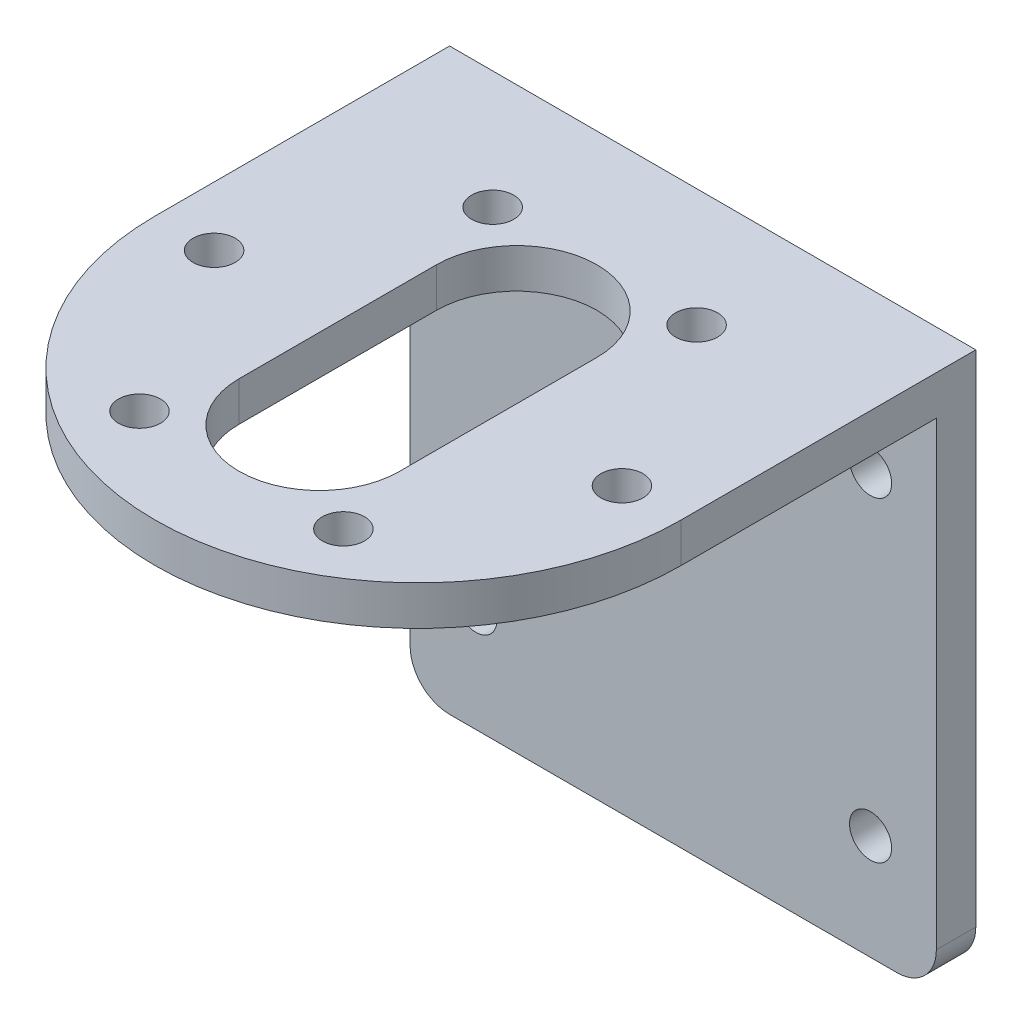
ISO-10303-21;
HEADER;
FILE_DESCRIPTION(('STEP AP214'),'2;1');
FILE_NAME('part.step','',(''),(''),'','','');
FILE_SCHEMA(('AUTOMOTIVE_DESIGN { 1 0 10303 214 1 1 1 1 }'));
ENDSEC;
DATA;
#1=APPLICATION_CONTEXT('core data for automotive mechanical design processes');
#2=APPLICATION_PROTOCOL_DEFINITION('international standard','automotive_design',2000,#1);
#3=PRODUCT_CONTEXT('',#1,'mechanical');
#4=PRODUCT('Part','Part','',(#3));
#5=PRODUCT_RELATED_PRODUCT_CATEGORY('part','',(#4));
#6=PRODUCT_DEFINITION_FORMATION('','',#4);
#7=PRODUCT_DEFINITION_CONTEXT('part definition',#1,'design');
#8=PRODUCT_DEFINITION('design','',#6,#7);
#9=PRODUCT_DEFINITION_SHAPE('','',#8);
#10=(LENGTH_UNIT() NAMED_UNIT(*) SI_UNIT(.MILLI.,.METRE.));
#11=(NAMED_UNIT(*) PLANE_ANGLE_UNIT() SI_UNIT($,.RADIAN.));
#12=(NAMED_UNIT(*) SI_UNIT($,.STERADIAN.) SOLID_ANGLE_UNIT());
#13=UNCERTAINTY_MEASURE_WITH_UNIT(LENGTH_MEASURE(1.E-05),#10,'distance_accuracy_value','');
#14=(GEOMETRIC_REPRESENTATION_CONTEXT(3) GLOBAL_UNCERTAINTY_ASSIGNED_CONTEXT((#13)) GLOBAL_UNIT_ASSIGNED_CONTEXT((#10,
#11,#12)) REPRESENTATION_CONTEXT('',''));
#15=CARTESIAN_POINT('',(0.,0.,0.));
#16=DIRECTION('',(0.,0.,1.));
#17=DIRECTION('',(1.,0.,0.));
#18=AXIS2_PLACEMENT_3D('',#15,#16,#17);
#19=CARTESIAN_POINT('',(20.386252918935,26.5499300024844,44.2));
#20=DIRECTION('',(-1.,0.,0.));
#21=DIRECTION('',(0.,-1.,0.));
#22=AXIS2_PLACEMENT_3D('',#19,#20,#21);
#23=PLANE('',#22);
#24=DIRECTION('',(0.,-1.,0.));
#25=VECTOR('',#24,1.);
#26=CARTESIAN_POINT('',(20.386252918935,33.5499300024844,22.4));
#27=LINE('',#26,#25);
#28=CARTESIAN_POINT('',(20.386252918935,26.5499300024844,22.4));
#29=VERTEX_POINT('',#28);
#30=CARTESIAN_POINT('',(20.386252918935,23.5499300024844,22.4));
#31=VERTEX_POINT('',#30);
#32=EDGE_CURVE('E186',#29,#31,#27,.T.);
#33=ORIENTED_EDGE('',*,*,#32,.T.);
#34=DIRECTION('',(0.,0.,1.));
#35=VECTOR('',#34,1.);
#36=CARTESIAN_POINT('',(20.386252918935,23.5499300024844,3.));
#37=LINE('',#36,#35);
#38=CARTESIAN_POINT('',(20.386252918935,23.5499300024844,3.));
#39=VERTEX_POINT('',#38);
#40=EDGE_CURVE('E248',#39,#31,#37,.T.);
#41=ORIENTED_EDGE('',*,*,#40,.F.);
#42=DIRECTION('',(0.,1.,0.));
#43=VECTOR('',#42,1.);
#44=CARTESIAN_POINT('',(20.386252918935,23.5499300024844,3.));
#45=LINE('',#44,#43);
#46=CARTESIAN_POINT('',(20.386252918935,-11.4500699975156,3.));
#47=VERTEX_POINT('',#46);
#48=EDGE_CURVE('E241',#47,#39,#45,.T.);
#49=ORIENTED_EDGE('',*,*,#48,.F.);
#50=DIRECTION('',(0.,0.,-1.));
#51=VECTOR('',#50,1.);
#52=CARTESIAN_POINT('',(20.386252918935,-11.4500699975156,44.2));
#53=LINE('',#52,#51);
#54=CARTESIAN_POINT('',(20.386252918935,-11.4500699975156,0.));
#55=VERTEX_POINT('',#54);
#56=EDGE_CURVE('E307',#47,#55,#53,.T.);
#57=ORIENTED_EDGE('',*,*,#56,.T.);
#58=DIRECTION('',(0.,1.,0.));
#59=VECTOR('',#58,1.);
#60=CARTESIAN_POINT('',(20.386252918935,26.5499300024844,0.));
#61=LINE('',#60,#59);
#62=CARTESIAN_POINT('',(20.386252918935,26.5499300024844,0.));
#63=VERTEX_POINT('',#62);
#64=EDGE_CURVE('E293',#55,#63,#61,.T.);
#65=ORIENTED_EDGE('',*,*,#64,.T.);
#66=DIRECTION('',(0.,0.,-1.));
#67=VECTOR('',#66,1.);
#68=CARTESIAN_POINT('',(20.386252918935,26.5499300024844,44.2));
#69=LINE('',#68,#67);
#70=EDGE_CURVE('E304',#29,#63,#69,.T.);
#71=ORIENTED_EDGE('',*,*,#70,.F.);
#72=EDGE_LOOP('',(#33,#41,#49,#57,#65,#71));
#73=FACE_BOUND('',#72,.T.);
#74=ADVANCED_FACE('F42',(#73),#23,.F.);
#75=CARTESIAN_POINT('',(-19.613747081065,26.5499300024844,44.2));
#76=DIRECTION('',(0.,-1.,0.));
#77=DIRECTION('',(0.,0.,-1.));
#78=AXIS2_PLACEMENT_3D('',#75,#76,#77);
#79=PLANE('',#78);
#80=CARTESIAN_POINT('',(8.13625291893495,26.5499300024844,35.8233937586588));
#81=DIRECTION('',(0.,-1.,0.));
#82=DIRECTION('',(0.,0.,-1.));
#83=AXIS2_PLACEMENT_3D('',#80,#81,#82);
#84=CIRCLE('',#83,1.59999999999999);
#85=CARTESIAN_POINT('',(8.13625291893495,26.5499300024844,34.2233937586589));
#86=VERTEX_POINT('',#85);
#87=EDGE_CURVE('E225',#86,#86,#84,.T.);
#88=ORIENTED_EDGE('',*,*,#87,.T.);
#89=EDGE_LOOP('',(#88));
#90=FACE_BOUND('',#89,.T.);
#91=CARTESIAN_POINT('',(8.13625291893514,26.5499300024844,8.97660624134127));
#92=DIRECTION('',(0.,-1.,0.));
#93=DIRECTION('',(0.,0.,-1.));
#94=AXIS2_PLACEMENT_3D('',#91,#92,#93);
#95=CIRCLE('',#94,1.59999999999999);
#96=CARTESIAN_POINT('',(8.13625291893514,26.5499300024844,7.37660624134127));
#97=VERTEX_POINT('',#96);
#98=EDGE_CURVE('E217',#97,#97,#95,.T.);
#99=ORIENTED_EDGE('',*,*,#98,.T.);
#100=EDGE_LOOP('',(#99));
#101=FACE_BOUND('',#100,.T.);
#102=CARTESIAN_POINT('',(-15.113747081065,26.5499300024844,22.3999999999998));
#103=DIRECTION('',(0.,-1.,0.));
#104=DIRECTION('',(0.,0.,-1.));
#105=AXIS2_PLACEMENT_3D('',#102,#103,#104);
#106=CIRCLE('',#105,1.6);
#107=CARTESIAN_POINT('',(-15.113747081065,26.5499300024844,20.7999999999998));
#108=VERTEX_POINT('',#107);
#109=EDGE_CURVE('E209',#108,#108,#106,.T.);
#110=ORIENTED_EDGE('',*,*,#109,.T.);
#111=EDGE_LOOP('',(#110));
#112=FACE_BOUND('',#111,.T.);
#113=DIRECTION('',(0.,0.,-1.));
#114=VECTOR('',#113,1.);
#115=CARTESIAN_POINT('',(-19.613747081065,26.5499300024844,44.2));
#116=LINE('',#115,#114);
#117=CARTESIAN_POINT('',(-19.613747081065,26.5499300024844,22.4));
#118=VERTEX_POINT('',#117);
#119=CARTESIAN_POINT('',(-19.613747081065,26.5499300024844,0.));
#120=VERTEX_POINT('',#119);
#121=EDGE_CURVE('E301',#118,#120,#116,.T.);
#122=ORIENTED_EDGE('',*,*,#121,.F.);
#123=CARTESIAN_POINT('',(0.386252918935025,26.5499300024844,22.4));
#124=DIRECTION('',(0.,-1.,0.));
#125=DIRECTION('',(0.,0.,-1.));
#126=AXIS2_PLACEMENT_3D('',#123,#124,#125);
#127=CIRCLE('',#126,20.);
#128=EDGE_CURVE('E190',#118,#29,#127,.F.);
#129=ORIENTED_EDGE('',*,*,#128,.T.);
#130=ORIENTED_EDGE('',*,*,#70,.T.);
#131=DIRECTION('',(-1.,0.,0.));
#132=VECTOR('',#131,1.);
#133=CARTESIAN_POINT('',(-19.613747081065,26.5499300024844,0.));
#134=LINE('',#133,#132);
#135=EDGE_CURVE('E297',#63,#120,#134,.T.);
#136=ORIENTED_EDGE('',*,*,#135,.T.);
#137=EDGE_LOOP('',(#122,#129,#130,#136));
#138=FACE_BOUND('',#137,.T.);
#139=DIRECTION('',(0.,0.,-1.));
#140=VECTOR('',#139,1.);
#141=CARTESIAN_POINT('',(-5.71374708106498,26.5499300024844,44.2));
#142=LINE('',#141,#140);
#143=CARTESIAN_POINT('',(-5.71374708106498,26.5499300024844,29.9));
#144=VERTEX_POINT('',#143);
#145=CARTESIAN_POINT('',(-5.71374708106498,26.5499300024844,14.9));
#146=VERTEX_POINT('',#145);
#147=EDGE_CURVE('E204',#144,#146,#142,.T.);
#148=ORIENTED_EDGE('',*,*,#147,.T.);
#149=CARTESIAN_POINT('',(0.386252918935025,26.5499300024844,14.9));
#150=DIRECTION('',(0.,-1.,0.));
#151=DIRECTION('',(0.,0.,-1.));
#152=AXIS2_PLACEMENT_3D('',#149,#150,#151);
#153=CIRCLE('',#152,6.1);
#154=CARTESIAN_POINT('',(6.48625291893503,26.5499300024844,14.9));
#155=VERTEX_POINT('',#154);
#156=EDGE_CURVE('E134',#146,#155,#153,.T.);
#157=ORIENTED_EDGE('',*,*,#156,.T.);
#158=DIRECTION('',(0.,0.,1.));
#159=VECTOR('',#158,1.);
#160=CARTESIAN_POINT('',(6.48625291893502,26.5499300024844,44.2));
#161=LINE('',#160,#159);
#162=CARTESIAN_POINT('',(6.48625291893503,26.5499300024844,29.9));
#163=VERTEX_POINT('',#162);
#164=EDGE_CURVE('E196',#155,#163,#161,.T.);
#165=ORIENTED_EDGE('',*,*,#164,.T.);
#166=CARTESIAN_POINT('',(0.386252918935023,26.5499300024844,29.9));
#167=DIRECTION('',(0.,-1.,0.));
#168=DIRECTION('',(0.,0.,-1.));
#169=AXIS2_PLACEMENT_3D('',#166,#167,#168);
#170=CIRCLE('',#169,6.1);
#171=EDGE_CURVE('E200',#163,#144,#170,.T.);
#172=ORIENTED_EDGE('',*,*,#171,.T.);
#173=EDGE_LOOP('',(#148,#157,#165,#172));
#174=FACE_BOUND('',#173,.T.);
#175=CARTESIAN_POINT('',(-7.36374708106489,26.5499300024844,8.97660624134115));
#176=DIRECTION('',(0.,-1.,0.));
#177=DIRECTION('',(0.,0.,-1.));
#178=AXIS2_PLACEMENT_3D('',#175,#176,#177);
#179=CIRCLE('',#178,1.6);
#180=CARTESIAN_POINT('',(-7.36374708106489,26.5499300024844,7.37660624134115));
#181=VERTEX_POINT('',#180);
#182=EDGE_CURVE('E213',#181,#181,#179,.T.);
#183=ORIENTED_EDGE('',*,*,#182,.T.);
#184=EDGE_LOOP('',(#183));
#185=FACE_BOUND('',#184,.T.);
#186=CARTESIAN_POINT('',(15.886252918935,26.5499300024844,22.4000000000002));
#187=DIRECTION('',(0.,-1.,0.));
#188=DIRECTION('',(0.,0.,-1.));
#189=AXIS2_PLACEMENT_3D('',#186,#187,#188);
#190=CIRCLE('',#189,1.6);
#191=CARTESIAN_POINT('',(15.886252918935,26.5499300024844,20.8000000000002));
#192=VERTEX_POINT('',#191);
#193=EDGE_CURVE('E221',#192,#192,#190,.T.);
#194=ORIENTED_EDGE('',*,*,#193,.T.);
#195=EDGE_LOOP('',(#194));
#196=FACE_BOUND('',#195,.T.);
#197=CARTESIAN_POINT('',(-7.36374708106509,26.5499300024844,35.8233937586587));
#198=DIRECTION('',(0.,-1.,0.));
#199=DIRECTION('',(0.,0.,-1.));
#200=AXIS2_PLACEMENT_3D('',#197,#198,#199);
#201=CIRCLE('',#200,1.59999999999999);
#202=CARTESIAN_POINT('',(-7.36374708106509,26.5499300024844,34.2233937586587));
#203=VERTEX_POINT('',#202);
#204=EDGE_CURVE('E229',#203,#203,#201,.T.);
#205=ORIENTED_EDGE('',*,*,#204,.T.);
#206=EDGE_LOOP('',(#205));
#207=FACE_BOUND('',#206,.T.);
#208=ADVANCED_FACE('F361',(#90,#101,#112,#138,#174,#185,#196,#207),#79,.F.);
#209=CARTESIAN_POINT('',(-19.613747081065,23.5499300024844,3.));
#210=DIRECTION('',(0.,1.,0.));
#211=DIRECTION('',(0.,0.,1.));
#212=AXIS2_PLACEMENT_3D('',#209,#210,#211);
#213=PLANE('',#212);
#214=CARTESIAN_POINT('',(8.13625291893495,23.5499300024844,35.8233937586588));
#215=DIRECTION('',(0.,-1.,0.));
#216=DIRECTION('',(0.,0.,-1.));
#217=AXIS2_PLACEMENT_3D('',#214,#215,#216);
#218=CIRCLE('',#217,1.59999999999999);
#219=CARTESIAN_POINT('',(8.13625291893495,23.5499300024844,34.2233937586589));
#220=VERTEX_POINT('',#219);
#221=EDGE_CURVE('E171',#220,#220,#218,.T.);
#222=ORIENTED_EDGE('',*,*,#221,.F.);
#223=EDGE_LOOP('',(#222));
#224=FACE_BOUND('',#223,.T.);
#225=CARTESIAN_POINT('',(8.13625291893514,23.5499300024844,8.97660624134127));
#226=DIRECTION('',(0.,-1.,0.));
#227=DIRECTION('',(0.,0.,-1.));
#228=AXIS2_PLACEMENT_3D('',#225,#226,#227);
#229=CIRCLE('',#228,1.59999999999999);
#230=CARTESIAN_POINT('',(8.13625291893514,23.5499300024844,7.37660624134127));
#231=VERTEX_POINT('',#230);
#232=EDGE_CURVE('E179',#231,#231,#229,.T.);
#233=ORIENTED_EDGE('',*,*,#232,.F.);
#234=EDGE_LOOP('',(#233));
#235=FACE_BOUND('',#234,.T.);
#236=CARTESIAN_POINT('',(-15.113747081065,23.5499300024844,22.3999999999998));
#237=DIRECTION('',(0.,-1.,0.));
#238=DIRECTION('',(0.,0.,-1.));
#239=AXIS2_PLACEMENT_3D('',#236,#237,#238);
#240=CIRCLE('',#239,1.6);
#241=CARTESIAN_POINT('',(-15.113747081065,23.5499300024844,20.7999999999998));
#242=VERTEX_POINT('',#241);
#243=EDGE_CURVE('E156',#242,#242,#240,.T.);
#244=ORIENTED_EDGE('',*,*,#243,.F.);
#245=EDGE_LOOP('',(#244));
#246=FACE_BOUND('',#245,.T.);
#247=ORIENTED_EDGE('',*,*,#40,.T.);
#248=CARTESIAN_POINT('',(0.386252918935025,23.5499300024844,22.4));
#249=DIRECTION('',(0.,1.,0.));
#250=DIRECTION('',(0.,0.,-1.));
#251=AXIS2_PLACEMENT_3D('',#248,#249,#250);
#252=CIRCLE('',#251,20.);
#253=CARTESIAN_POINT('',(-19.613747081065,23.5499300024844,22.4));
#254=VERTEX_POINT('',#253);
#255=EDGE_CURVE('E170',#254,#31,#252,.T.);
#256=ORIENTED_EDGE('',*,*,#255,.F.);
#257=DIRECTION('',(0.,0.,1.));
#258=VECTOR('',#257,1.);
#259=CARTESIAN_POINT('',(-19.613747081065,23.5499300024844,3.));
#260=LINE('',#259,#258);
#261=CARTESIAN_POINT('',(-19.613747081065,23.5499300024844,3.));
#262=VERTEX_POINT('',#261);
#263=EDGE_CURVE('E249',#262,#254,#260,.T.);
#264=ORIENTED_EDGE('',*,*,#263,.F.);
#265=DIRECTION('',(-1.,0.,0.));
#266=VECTOR('',#265,1.);
#267=CARTESIAN_POINT('',(-19.613747081065,23.5499300024844,3.));
#268=LINE('',#267,#266);
#269=EDGE_CURVE('E244',#39,#262,#268,.T.);
#270=ORIENTED_EDGE('',*,*,#269,.F.);
#271=EDGE_LOOP('',(#247,#256,#264,#270));
#272=FACE_BOUND('',#271,.T.);
#273=DIRECTION('',(0.,0.,1.));
#274=VECTOR('',#273,1.);
#275=CARTESIAN_POINT('',(6.48625291893503,23.5499300024844,14.9));
#276=LINE('',#275,#274);
#277=CARTESIAN_POINT('',(6.48625291893503,23.5499300024844,14.9));
#278=VERTEX_POINT('',#277);
#279=CARTESIAN_POINT('',(6.48625291893503,23.5499300024844,29.9));
#280=VERTEX_POINT('',#279);
#281=EDGE_CURVE('E154',#278,#280,#276,.T.);
#282=ORIENTED_EDGE('',*,*,#281,.F.);
#283=CARTESIAN_POINT('',(0.386252918935025,23.5499300024844,14.9));
#284=DIRECTION('',(0.,-1.,0.));
#285=DIRECTION('',(0.,0.,-1.));
#286=AXIS2_PLACEMENT_3D('',#283,#284,#285);
#287=CIRCLE('',#286,6.1);
#288=CARTESIAN_POINT('',(-5.71374708106498,23.5499300024844,14.9));
#289=VERTEX_POINT('',#288);
#290=EDGE_CURVE('E66',#289,#278,#287,.T.);
#291=ORIENTED_EDGE('',*,*,#290,.F.);
#292=DIRECTION('',(0.,0.,-1.));
#293=VECTOR('',#292,1.);
#294=CARTESIAN_POINT('',(-5.71374708106498,23.5499300024844,14.9));
#295=LINE('',#294,#293);
#296=CARTESIAN_POINT('',(-5.71374708106498,23.5499300024844,29.9));
#297=VERTEX_POINT('',#296);
#298=EDGE_CURVE('E141',#297,#289,#295,.T.);
#299=ORIENTED_EDGE('',*,*,#298,.F.);
#300=CARTESIAN_POINT('',(0.386252918935023,23.5499300024844,29.9));
#301=DIRECTION('',(0.,-1.,0.));
#302=DIRECTION('',(0.,0.,-1.));
#303=AXIS2_PLACEMENT_3D('',#300,#301,#302);
#304=CIRCLE('',#303,6.1);
#305=EDGE_CURVE('E148',#280,#297,#304,.T.);
#306=ORIENTED_EDGE('',*,*,#305,.F.);
#307=EDGE_LOOP('',(#282,#291,#299,#306));
#308=FACE_BOUND('',#307,.T.);
#309=CARTESIAN_POINT('',(-7.36374708106489,23.5499300024844,8.97660624134115));
#310=DIRECTION('',(0.,-1.,0.));
#311=DIRECTION('',(0.,0.,-1.));
#312=AXIS2_PLACEMENT_3D('',#309,#310,#311);
#313=CIRCLE('',#312,1.6);
#314=CARTESIAN_POINT('',(-7.36374708106489,23.5499300024844,7.37660624134115));
#315=VERTEX_POINT('',#314);
#316=EDGE_CURVE('E161',#315,#315,#313,.T.);
#317=ORIENTED_EDGE('',*,*,#316,.F.);
#318=EDGE_LOOP('',(#317));
#319=FACE_BOUND('',#318,.T.);
#320=CARTESIAN_POINT('',(15.886252918935,23.5499300024844,22.4000000000002));
#321=DIRECTION('',(0.,-1.,0.));
#322=DIRECTION('',(0.,0.,-1.));
#323=AXIS2_PLACEMENT_3D('',#320,#321,#322);
#324=CIRCLE('',#323,1.6);
#325=CARTESIAN_POINT('',(15.886252918935,23.5499300024844,20.8000000000002));
#326=VERTEX_POINT('',#325);
#327=EDGE_CURVE('E175',#326,#326,#324,.T.);
#328=ORIENTED_EDGE('',*,*,#327,.F.);
#329=EDGE_LOOP('',(#328));
#330=FACE_BOUND('',#329,.T.);
#331=CARTESIAN_POINT('',(-7.36374708106509,23.5499300024844,35.8233937586587));
#332=DIRECTION('',(0.,-1.,0.));
#333=DIRECTION('',(0.,0.,-1.));
#334=AXIS2_PLACEMENT_3D('',#331,#332,#333);
#335=CIRCLE('',#334,1.59999999999999);
#336=CARTESIAN_POINT('',(-7.36374708106509,23.5499300024844,34.2233937586587));
#337=VERTEX_POINT('',#336);
#338=EDGE_CURVE('E166',#337,#337,#335,.T.);
#339=ORIENTED_EDGE('',*,*,#338,.F.);
#340=EDGE_LOOP('',(#339));
#341=FACE_BOUND('',#340,.T.);
#342=ADVANCED_FACE('F152',(#224,#235,#246,#272,#308,#319,#330,#341),#213,.F.);
#343=CARTESIAN_POINT('',(-19.613747081065,-14.4500699975156,44.2));
#344=DIRECTION('',(0.,1.,0.));
#345=DIRECTION('',(0.,0.,1.));
#346=AXIS2_PLACEMENT_3D('',#343,#344,#345);
#347=PLANE('',#346);
#348=DIRECTION('',(1.,0.,0.));
#349=VECTOR('',#348,1.);
#350=CARTESIAN_POINT('',(-19.613747081065,-14.4500699975156,0.));
#351=LINE('',#350,#349);
#352=CARTESIAN_POINT('',(-16.613747081065,-14.4500699975156,0.));
#353=VERTEX_POINT('',#352);
#354=CARTESIAN_POINT('',(17.386252918935,-14.4500699975156,0.));
#355=VERTEX_POINT('',#354);
#356=EDGE_CURVE('E289',#353,#355,#351,.T.);
#357=ORIENTED_EDGE('',*,*,#356,.T.);
#358=DIRECTION('',(0.,0.,-1.));
#359=VECTOR('',#358,1.);
#360=CARTESIAN_POINT('',(17.386252918935,-14.4500699975156,44.2));
#361=LINE('',#360,#359);
#362=CARTESIAN_POINT('',(17.386252918935,-14.4500699975156,3.));
#363=VERTEX_POINT('',#362);
#364=EDGE_CURVE('E324',#355,#363,#361,.F.);
#365=ORIENTED_EDGE('',*,*,#364,.T.);
#366=DIRECTION('',(1.,0.,0.));
#367=VECTOR('',#366,1.);
#368=CARTESIAN_POINT('',(-19.613747081065,-14.4500699975156,3.));
#369=LINE('',#368,#367);
#370=CARTESIAN_POINT('',(-16.613747081065,-14.4500699975156,3.));
#371=VERTEX_POINT('',#370);
#372=EDGE_CURVE('E237',#371,#363,#369,.T.);
#373=ORIENTED_EDGE('',*,*,#372,.F.);
#374=DIRECTION('',(0.,0.,-1.));
#375=VECTOR('',#374,1.);
#376=CARTESIAN_POINT('',(-16.613747081065,-14.4500699975156,44.2));
#377=LINE('',#376,#375);
#378=EDGE_CURVE('E320',#371,#353,#377,.T.);
#379=ORIENTED_EDGE('',*,*,#378,.T.);
#380=EDGE_LOOP('',(#357,#365,#373,#379));
#381=FACE_BOUND('',#380,.T.);
#382=ADVANCED_FACE('F349',(#381),#347,.F.);
#383=CARTESIAN_POINT('',(-14.613747081065,-6.45006999751565,44.2));
#384=DIRECTION('',(0.,0.,-1.));
#385=DIRECTION('',(-1.,0.,0.));
#386=AXIS2_PLACEMENT_3D('',#383,#384,#385);
#387=CYLINDRICAL_SURFACE('',#386,1.6);
#388=CARTESIAN_POINT('',(-14.613747081065,-6.45006999751565,0.));
#389=DIRECTION('',(0.,0.,1.));
#390=DIRECTION('',(1.,0.,0.));
#391=AXIS2_PLACEMENT_3D('',#388,#389,#390);
#392=CIRCLE('',#391,1.6);
#393=CARTESIAN_POINT('',(-13.013747081065,-6.45006999751565,0.));
#394=VERTEX_POINT('',#393);
#395=EDGE_CURVE('E281',#394,#394,#392,.T.);
#396=ORIENTED_EDGE('',*,*,#395,.F.);
#397=EDGE_LOOP('',(#396));
#398=FACE_BOUND('',#397,.T.);
#399=CARTESIAN_POINT('',(-14.613747081065,-6.45006999751565,3.));
#400=DIRECTION('',(0.,0.,1.));
#401=DIRECTION('',(1.,0.,0.));
#402=AXIS2_PLACEMENT_3D('',#399,#400,#401);
#403=CIRCLE('',#402,1.6);
#404=CARTESIAN_POINT('',(-13.013747081065,-6.45006999751565,3.));
#405=VERTEX_POINT('',#404);
#406=EDGE_CURVE('E265',#405,#405,#403,.T.);
#407=ORIENTED_EDGE('',*,*,#406,.T.);
#408=EDGE_LOOP('',(#407));
#409=FACE_BOUND('',#408,.T.);
#410=ADVANCED_FACE('F388',(#398,#409),#387,.F.);
#411=CARTESIAN_POINT('',(15.386252918935,-6.45006999751565,44.2));
#412=DIRECTION('',(0.,0.,-1.));
#413=DIRECTION('',(-1.,0.,0.));
#414=AXIS2_PLACEMENT_3D('',#411,#412,#413);
#415=CYLINDRICAL_SURFACE('',#414,1.6);
#416=CARTESIAN_POINT('',(15.386252918935,-6.45006999751565,0.));
#417=DIRECTION('',(0.,0.,1.));
#418=DIRECTION('',(1.,0.,0.));
#419=AXIS2_PLACEMENT_3D('',#416,#417,#418);
#420=CIRCLE('',#419,1.6);
#421=CARTESIAN_POINT('',(16.986252918935,-6.45006999751565,0.));
#422=VERTEX_POINT('',#421);
#423=EDGE_CURVE('E277',#422,#422,#420,.T.);
#424=ORIENTED_EDGE('',*,*,#423,.F.);
#425=EDGE_LOOP('',(#424));
#426=FACE_BOUND('',#425,.T.);
#427=CARTESIAN_POINT('',(15.386252918935,-6.45006999751565,3.));
#428=DIRECTION('',(0.,0.,1.));
#429=DIRECTION('',(1.,0.,0.));
#430=AXIS2_PLACEMENT_3D('',#427,#428,#429);
#431=CIRCLE('',#430,1.6);
#432=CARTESIAN_POINT('',(16.986252918935,-6.45006999751565,3.));
#433=VERTEX_POINT('',#432);
#434=EDGE_CURVE('E261',#433,#433,#431,.T.);
#435=ORIENTED_EDGE('',*,*,#434,.T.);
#436=EDGE_LOOP('',(#435));
#437=FACE_BOUND('',#436,.T.);
#438=ADVANCED_FACE('F410',(#426,#437),#415,.F.);
#439=CARTESIAN_POINT('',(-14.613747081065,17.5499300024844,44.2));
#440=DIRECTION('',(0.,0.,-1.));
#441=DIRECTION('',(-1.,0.,0.));
#442=AXIS2_PLACEMENT_3D('',#439,#440,#441);
#443=CYLINDRICAL_SURFACE('',#442,1.6);
#444=CARTESIAN_POINT('',(-14.613747081065,17.5499300024844,0.));
#445=DIRECTION('',(0.,0.,1.));
#446=DIRECTION('',(1.,0.,0.));
#447=AXIS2_PLACEMENT_3D('',#444,#445,#446);
#448=CIRCLE('',#447,1.6);
#449=CARTESIAN_POINT('',(-13.013747081065,17.5499300024844,0.));
#450=VERTEX_POINT('',#449);
#451=EDGE_CURVE('E273',#450,#450,#448,.T.);
#452=ORIENTED_EDGE('',*,*,#451,.F.);
#453=EDGE_LOOP('',(#452));
#454=FACE_BOUND('',#453,.T.);
#455=CARTESIAN_POINT('',(-14.613747081065,17.5499300024844,3.));
#456=DIRECTION('',(0.,0.,1.));
#457=DIRECTION('',(1.,0.,0.));
#458=AXIS2_PLACEMENT_3D('',#455,#456,#457);
#459=CIRCLE('',#458,1.6);
#460=CARTESIAN_POINT('',(-13.013747081065,17.5499300024844,3.));
#461=VERTEX_POINT('',#460);
#462=EDGE_CURVE('E257',#461,#461,#459,.T.);
#463=ORIENTED_EDGE('',*,*,#462,.T.);
#464=EDGE_LOOP('',(#463));
#465=FACE_BOUND('',#464,.T.);
#466=ADVANCED_FACE('F406',(#454,#465),#443,.F.);
#467=CARTESIAN_POINT('',(15.386252918935,17.5499300024844,44.2));
#468=DIRECTION('',(0.,0.,-1.));
#469=DIRECTION('',(-1.,0.,0.));
#470=AXIS2_PLACEMENT_3D('',#467,#468,#469);
#471=CYLINDRICAL_SURFACE('',#470,1.6);
#472=CARTESIAN_POINT('',(15.386252918935,17.5499300024844,0.));
#473=DIRECTION('',(0.,0.,1.));
#474=DIRECTION('',(1.,0.,0.));
#475=AXIS2_PLACEMENT_3D('',#472,#473,#474);
#476=CIRCLE('',#475,1.6);
#477=CARTESIAN_POINT('',(16.986252918935,17.5499300024844,0.));
#478=VERTEX_POINT('',#477);
#479=EDGE_CURVE('E269',#478,#478,#476,.T.);
#480=ORIENTED_EDGE('',*,*,#479,.F.);
#481=EDGE_LOOP('',(#480));
#482=FACE_BOUND('',#481,.T.);
#483=CARTESIAN_POINT('',(15.386252918935,17.5499300024844,3.));
#484=DIRECTION('',(0.,0.,1.));
#485=DIRECTION('',(1.,0.,0.));
#486=AXIS2_PLACEMENT_3D('',#483,#484,#485);
#487=CIRCLE('',#486,1.6);
#488=CARTESIAN_POINT('',(16.986252918935,17.5499300024844,3.));
#489=VERTEX_POINT('',#488);
#490=EDGE_CURVE('E253',#489,#489,#487,.T.);
#491=ORIENTED_EDGE('',*,*,#490,.T.);
#492=EDGE_LOOP('',(#491));
#493=FACE_BOUND('',#492,.T.);
#494=ADVANCED_FACE('F403',(#482,#493),#471,.F.);
#495=CARTESIAN_POINT('',(0.,0.,0.));
#496=DIRECTION('',(0.,0.,1.));
#497=DIRECTION('',(1.,0.,0.));
#498=AXIS2_PLACEMENT_3D('',#495,#496,#497);
#499=PLANE('',#498);
#500=ORIENTED_EDGE('',*,*,#64,.F.);
#501=CARTESIAN_POINT('',(17.386252918935,-11.4500699975156,0.));
#502=DIRECTION('',(0.,0.,1.));
#503=DIRECTION('',(1.,0.,0.));
#504=AXIS2_PLACEMENT_3D('',#501,#502,#503);
#505=CIRCLE('',#504,3.);
#506=EDGE_CURVE('E317',#55,#355,#505,.F.);
#507=ORIENTED_EDGE('',*,*,#506,.T.);
#508=ORIENTED_EDGE('',*,*,#356,.F.);
#509=CARTESIAN_POINT('',(-16.613747081065,-11.4500699975156,0.));
#510=DIRECTION('',(0.,0.,1.));
#511=DIRECTION('',(1.,0.,0.));
#512=AXIS2_PLACEMENT_3D('',#509,#510,#511);
#513=CIRCLE('',#512,3.);
#514=CARTESIAN_POINT('',(-19.613747081065,-11.4500699975156,0.));
#515=VERTEX_POINT('',#514);
#516=EDGE_CURVE('E314',#353,#515,#513,.F.);
#517=ORIENTED_EDGE('',*,*,#516,.T.);
#518=DIRECTION('',(0.,-1.,0.));
#519=VECTOR('',#518,1.);
#520=CARTESIAN_POINT('',(-19.613747081065,26.5499300024844,0.));
#521=LINE('',#520,#519);
#522=EDGE_CURVE('E285',#120,#515,#521,.T.);
#523=ORIENTED_EDGE('',*,*,#522,.F.);
#524=ORIENTED_EDGE('',*,*,#135,.F.);
#525=EDGE_LOOP('',(#500,#507,#508,#517,#523,#524));
#526=FACE_BOUND('',#525,.T.);
#527=ORIENTED_EDGE('',*,*,#395,.T.);
#528=EDGE_LOOP('',(#527));
#529=FACE_BOUND('',#528,.T.);
#530=ORIENTED_EDGE('',*,*,#423,.T.);
#531=EDGE_LOOP('',(#530));
#532=FACE_BOUND('',#531,.T.);
#533=ORIENTED_EDGE('',*,*,#451,.T.);
#534=EDGE_LOOP('',(#533));
#535=FACE_BOUND('',#534,.T.);
#536=ORIENTED_EDGE('',*,*,#479,.T.);
#537=EDGE_LOOP('',(#536));
#538=FACE_BOUND('',#537,.T.);
#539=ADVANCED_FACE('F345',(#526,#529,#532,#535,#538),#499,.F.);
#540=CARTESIAN_POINT('',(-19.613747081065,26.5499300024844,44.2));
#541=DIRECTION('',(1.,0.,0.));
#542=DIRECTION('',(0.,0.,-1.));
#543=AXIS2_PLACEMENT_3D('',#540,#541,#542);
#544=PLANE('',#543);
#545=ORIENTED_EDGE('',*,*,#263,.T.);
#546=DIRECTION('',(0.,-1.,0.));
#547=VECTOR('',#546,1.);
#548=CARTESIAN_POINT('',(-19.613747081065,33.5499300024844,22.4));
#549=LINE('',#548,#547);
#550=EDGE_CURVE('E185',#118,#254,#549,.T.);
#551=ORIENTED_EDGE('',*,*,#550,.F.);
#552=ORIENTED_EDGE('',*,*,#121,.T.);
#553=ORIENTED_EDGE('',*,*,#522,.T.);
#554=DIRECTION('',(0.,0.,-1.));
#555=VECTOR('',#554,1.);
#556=CARTESIAN_POINT('',(-19.613747081065,-11.4500699975156,44.2));
#557=LINE('',#556,#555);
#558=CARTESIAN_POINT('',(-19.613747081065,-11.4500699975156,3.));
#559=VERTEX_POINT('',#558);
#560=EDGE_CURVE('E11',#515,#559,#557,.F.);
#561=ORIENTED_EDGE('',*,*,#560,.T.);
#562=DIRECTION('',(0.,-1.,0.));
#563=VECTOR('',#562,1.);
#564=CARTESIAN_POINT('',(-19.613747081065,23.5499300024844,3.));
#565=LINE('',#564,#563);
#566=EDGE_CURVE('E233',#262,#559,#565,.T.);
#567=ORIENTED_EDGE('',*,*,#566,.F.);
#568=EDGE_LOOP('',(#545,#551,#552,#553,#561,#567));
#569=FACE_BOUND('',#568,.T.);
#570=ADVANCED_FACE('F356',(#569),#544,.F.);
#571=CARTESIAN_POINT('',(0.,0.,3.));
#572=DIRECTION('',(0.,0.,1.));
#573=DIRECTION('',(1.,0.,0.));
#574=AXIS2_PLACEMENT_3D('',#571,#572,#573);
#575=PLANE('',#574);
#576=ORIENTED_EDGE('',*,*,#406,.F.);
#577=EDGE_LOOP('',(#576));
#578=FACE_BOUND('',#577,.T.);
#579=ORIENTED_EDGE('',*,*,#434,.F.);
#580=EDGE_LOOP('',(#579));
#581=FACE_BOUND('',#580,.T.);
#582=ORIENTED_EDGE('',*,*,#462,.F.);
#583=EDGE_LOOP('',(#582));
#584=FACE_BOUND('',#583,.T.);
#585=ORIENTED_EDGE('',*,*,#490,.F.);
#586=EDGE_LOOP('',(#585));
#587=FACE_BOUND('',#586,.T.);
#588=ORIENTED_EDGE('',*,*,#372,.T.);
#589=CARTESIAN_POINT('',(17.386252918935,-11.4500699975156,3.));
#590=DIRECTION('',(0.,0.,1.));
#591=DIRECTION('',(1.,0.,0.));
#592=AXIS2_PLACEMENT_3D('',#589,#590,#591);
#593=CIRCLE('',#592,3.);
#594=EDGE_CURVE('E51',#363,#47,#593,.T.);
#595=ORIENTED_EDGE('',*,*,#594,.T.);
#596=ORIENTED_EDGE('',*,*,#48,.T.);
#597=ORIENTED_EDGE('',*,*,#269,.T.);
#598=ORIENTED_EDGE('',*,*,#566,.T.);
#599=CARTESIAN_POINT('',(-16.613747081065,-11.4500699975156,3.));
#600=DIRECTION('',(0.,0.,1.));
#601=DIRECTION('',(1.,0.,0.));
#602=AXIS2_PLACEMENT_3D('',#599,#600,#601);
#603=CIRCLE('',#602,3.);
#604=EDGE_CURVE('E327',#559,#371,#603,.T.);
#605=ORIENTED_EDGE('',*,*,#604,.T.);
#606=EDGE_LOOP('',(#588,#595,#596,#597,#598,#605));
#607=FACE_BOUND('',#606,.T.);
#608=ADVANCED_FACE('F333',(#578,#581,#584,#587,#607),#575,.T.);
#609=CARTESIAN_POINT('',(17.386252918935,-11.4500699975156,44.2));
#610=DIRECTION('',(0.,0.,-1.));
#611=DIRECTION('',(-1.,0.,0.));
#612=AXIS2_PLACEMENT_3D('',#609,#610,#611);
#613=CYLINDRICAL_SURFACE('',#612,3.);
#614=ORIENTED_EDGE('',*,*,#594,.F.);
#615=ORIENTED_EDGE('',*,*,#364,.F.);
#616=ORIENTED_EDGE('',*,*,#506,.F.);
#617=ORIENTED_EDGE('',*,*,#56,.F.);
#618=EDGE_LOOP('',(#614,#615,#616,#617));
#619=FACE_BOUND('',#618,.T.);
#620=ADVANCED_FACE('F342',(#619),#613,.T.);
#621=CARTESIAN_POINT('',(-16.613747081065,-11.4500699975156,44.2));
#622=DIRECTION('',(0.,0.,-1.));
#623=DIRECTION('',(-1.,0.,0.));
#624=AXIS2_PLACEMENT_3D('',#621,#622,#623);
#625=CYLINDRICAL_SURFACE('',#624,3.);
#626=ORIENTED_EDGE('',*,*,#604,.F.);
#627=ORIENTED_EDGE('',*,*,#560,.F.);
#628=ORIENTED_EDGE('',*,*,#516,.F.);
#629=ORIENTED_EDGE('',*,*,#378,.F.);
#630=EDGE_LOOP('',(#626,#627,#628,#629));
#631=FACE_BOUND('',#630,.T.);
#632=ADVANCED_FACE('F44',(#631),#625,.T.);
#633=CARTESIAN_POINT('',(0.386252918935025,33.5499300024844,22.4));
#634=DIRECTION('',(0.,-1.,0.));
#635=DIRECTION('',(0.,0.,-1.));
#636=AXIS2_PLACEMENT_3D('',#633,#634,#635);
#637=CYLINDRICAL_SURFACE('',#636,20.);
#638=ORIENTED_EDGE('',*,*,#550,.T.);
#639=ORIENTED_EDGE('',*,*,#255,.T.);
#640=ORIENTED_EDGE('',*,*,#32,.F.);
#641=ORIENTED_EDGE('',*,*,#128,.F.);
#642=EDGE_LOOP('',(#638,#639,#640,#641));
#643=FACE_BOUND('',#642,.T.);
#644=ADVANCED_FACE('F367',(#643),#637,.T.);
#645=CARTESIAN_POINT('',(0.386252918935025,33.5499300024844,14.9));
#646=DIRECTION('',(0.,-1.,0.));
#647=DIRECTION('',(0.,0.,-1.));
#648=AXIS2_PLACEMENT_3D('',#645,#646,#647);
#649=CYLINDRICAL_SURFACE('',#648,6.1);
#650=DIRECTION('',(0.,-1.,0.));
#651=VECTOR('',#650,1.);
#652=CARTESIAN_POINT('',(-5.71374708106498,33.5499300024844,14.9));
#653=LINE('',#652,#651);
#654=EDGE_CURVE('E130',#146,#289,#653,.T.);
#655=ORIENTED_EDGE('',*,*,#654,.T.);
#656=ORIENTED_EDGE('',*,*,#290,.T.);
#657=DIRECTION('',(0.,-1.,0.));
#658=VECTOR('',#657,1.);
#659=CARTESIAN_POINT('',(6.48625291893503,33.5499300024844,14.9));
#660=LINE('',#659,#658);
#661=EDGE_CURVE('E149',#155,#278,#660,.T.);
#662=ORIENTED_EDGE('',*,*,#661,.F.);
#663=ORIENTED_EDGE('',*,*,#156,.F.);
#664=EDGE_LOOP('',(#655,#656,#662,#663));
#665=FACE_BOUND('',#664,.T.);
#666=ADVANCED_FACE('F132',(#665),#649,.F.);
#667=CARTESIAN_POINT('',(-5.71374708106498,33.5499300024844,14.9));
#668=DIRECTION('',(-1.,0.,0.));
#669=DIRECTION('',(0.,0.,1.));
#670=AXIS2_PLACEMENT_3D('',#667,#668,#669);
#671=PLANE('',#670);
#672=DIRECTION('',(0.,-1.,0.));
#673=VECTOR('',#672,1.);
#674=CARTESIAN_POINT('',(-5.71374708106498,33.5499300024844,29.9));
#675=LINE('',#674,#673);
#676=EDGE_CURVE('E138',#144,#297,#675,.T.);
#677=ORIENTED_EDGE('',*,*,#676,.T.);
#678=ORIENTED_EDGE('',*,*,#298,.T.);
#679=ORIENTED_EDGE('',*,*,#654,.F.);
#680=ORIENTED_EDGE('',*,*,#147,.F.);
#681=EDGE_LOOP('',(#677,#678,#679,#680));
#682=FACE_BOUND('',#681,.T.);
#683=ADVANCED_FACE('F142',(#682),#671,.F.);
#684=CARTESIAN_POINT('',(0.386252918935023,33.5499300024844,29.9));
#685=DIRECTION('',(0.,-1.,0.));
#686=DIRECTION('',(0.,0.,-1.));
#687=AXIS2_PLACEMENT_3D('',#684,#685,#686);
#688=CYLINDRICAL_SURFACE('',#687,6.1);
#689=DIRECTION('',(0.,-1.,0.));
#690=VECTOR('',#689,1.);
#691=CARTESIAN_POINT('',(6.48625291893503,33.5499300024844,29.9));
#692=LINE('',#691,#690);
#693=EDGE_CURVE('E58',#163,#280,#692,.T.);
#694=ORIENTED_EDGE('',*,*,#693,.T.);
#695=ORIENTED_EDGE('',*,*,#305,.T.);
#696=ORIENTED_EDGE('',*,*,#676,.F.);
#697=ORIENTED_EDGE('',*,*,#171,.F.);
#698=EDGE_LOOP('',(#694,#695,#696,#697));
#699=FACE_BOUND('',#698,.T.);
#700=ADVANCED_FACE('F455',(#699),#688,.F.);
#701=CARTESIAN_POINT('',(6.48625291893503,33.5499300024844,14.9));
#702=DIRECTION('',(1.,0.,0.));
#703=DIRECTION('',(0.,0.,-1.));
#704=AXIS2_PLACEMENT_3D('',#701,#702,#703);
#705=PLANE('',#704);
#706=ORIENTED_EDGE('',*,*,#661,.T.);
#707=ORIENTED_EDGE('',*,*,#281,.T.);
#708=ORIENTED_EDGE('',*,*,#693,.F.);
#709=ORIENTED_EDGE('',*,*,#164,.F.);
#710=EDGE_LOOP('',(#706,#707,#708,#709));
#711=FACE_BOUND('',#710,.T.);
#712=ADVANCED_FACE('F465',(#711),#705,.F.);
#713=CARTESIAN_POINT('',(-15.113747081065,33.5499300024844,22.3999999999998));
#714=DIRECTION('',(0.,-1.,0.));
#715=DIRECTION('',(0.,0.,-1.));
#716=AXIS2_PLACEMENT_3D('',#713,#714,#715);
#717=CYLINDRICAL_SURFACE('',#716,1.6);
#718=ORIENTED_EDGE('',*,*,#243,.T.);
#719=EDGE_LOOP('',(#718));
#720=FACE_BOUND('',#719,.T.);
#721=ORIENTED_EDGE('',*,*,#109,.F.);
#722=EDGE_LOOP('',(#721));
#723=FACE_BOUND('',#722,.T.);
#724=ADVANCED_FACE('F476',(#720,#723),#717,.F.);
#725=CARTESIAN_POINT('',(-7.36374708106489,33.5499300024844,8.97660624134115));
#726=DIRECTION('',(0.,-1.,0.));
#727=DIRECTION('',(0.,0.,-1.));
#728=AXIS2_PLACEMENT_3D('',#725,#726,#727);
#729=CYLINDRICAL_SURFACE('',#728,1.6);
#730=ORIENTED_EDGE('',*,*,#316,.T.);
#731=EDGE_LOOP('',(#730));
#732=FACE_BOUND('',#731,.T.);
#733=ORIENTED_EDGE('',*,*,#182,.F.);
#734=EDGE_LOOP('',(#733));
#735=FACE_BOUND('',#734,.T.);
#736=ADVANCED_FACE('F486',(#732,#735),#729,.F.);
#737=CARTESIAN_POINT('',(8.13625291893514,33.5499300024844,8.97660624134127));
#738=DIRECTION('',(0.,-1.,0.));
#739=DIRECTION('',(0.,0.,-1.));
#740=AXIS2_PLACEMENT_3D('',#737,#738,#739);
#741=CYLINDRICAL_SURFACE('',#740,1.59999999999999);
#742=ORIENTED_EDGE('',*,*,#232,.T.);
#743=EDGE_LOOP('',(#742));
#744=FACE_BOUND('',#743,.T.);
#745=ORIENTED_EDGE('',*,*,#98,.F.);
#746=EDGE_LOOP('',(#745));
#747=FACE_BOUND('',#746,.T.);
#748=ADVANCED_FACE('F497',(#744,#747),#741,.F.);
#749=CARTESIAN_POINT('',(15.886252918935,33.5499300024844,22.4000000000002));
#750=DIRECTION('',(0.,-1.,0.));
#751=DIRECTION('',(0.,0.,-1.));
#752=AXIS2_PLACEMENT_3D('',#749,#750,#751);
#753=CYLINDRICAL_SURFACE('',#752,1.6);
#754=ORIENTED_EDGE('',*,*,#327,.T.);
#755=EDGE_LOOP('',(#754));
#756=FACE_BOUND('',#755,.T.);
#757=ORIENTED_EDGE('',*,*,#193,.F.);
#758=EDGE_LOOP('',(#757));
#759=FACE_BOUND('',#758,.T.);
#760=ADVANCED_FACE('F508',(#756,#759),#753,.F.);
#761=CARTESIAN_POINT('',(8.13625291893495,33.5499300024844,35.8233937586588));
#762=DIRECTION('',(0.,-1.,0.));
#763=DIRECTION('',(0.,0.,-1.));
#764=AXIS2_PLACEMENT_3D('',#761,#762,#763);
#765=CYLINDRICAL_SURFACE('',#764,1.59999999999999);
#766=ORIENTED_EDGE('',*,*,#221,.T.);
#767=EDGE_LOOP('',(#766));
#768=FACE_BOUND('',#767,.T.);
#769=ORIENTED_EDGE('',*,*,#87,.F.);
#770=EDGE_LOOP('',(#769));
#771=FACE_BOUND('',#770,.T.);
#772=ADVANCED_FACE('F518',(#768,#771),#765,.F.);
#773=CARTESIAN_POINT('',(-7.36374708106509,33.5499300024844,35.8233937586587));
#774=DIRECTION('',(0.,-1.,0.));
#775=DIRECTION('',(0.,0.,-1.));
#776=AXIS2_PLACEMENT_3D('',#773,#774,#775);
#777=CYLINDRICAL_SURFACE('',#776,1.59999999999999);
#778=ORIENTED_EDGE('',*,*,#338,.T.);
#779=EDGE_LOOP('',(#778));
#780=FACE_BOUND('',#779,.T.);
#781=ORIENTED_EDGE('',*,*,#204,.F.);
#782=EDGE_LOOP('',(#781));
#783=FACE_BOUND('',#782,.T.);
#784=ADVANCED_FACE('F529',(#780,#783),#777,.F.);
#785=CLOSED_SHELL('',(#74,#208,#342,#382,#410,#438,#466,#494,#539,#570,#608,#620,#632,#644,#666,
#683,#700,#712,#724,#736,#748,#760,#772,#784));
#786=MANIFOLD_SOLID_BREP('B2',#785);
#787=ADVANCED_BREP_SHAPE_REPRESENTATION('',(#18,#786),#14);
#788=SHAPE_DEFINITION_REPRESENTATION(#9,#787);
ENDSEC;
END-ISO-10303-21;
